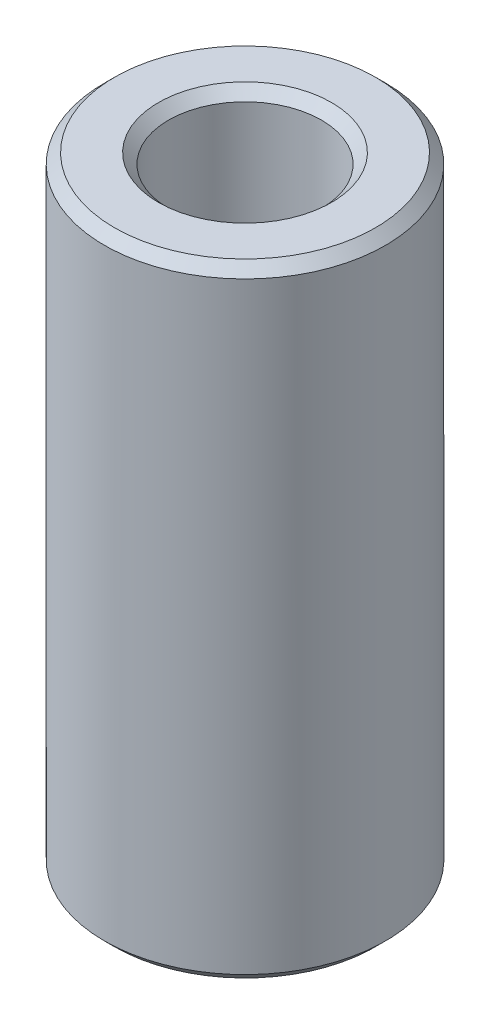
ISO-10303-21;
HEADER;
FILE_DESCRIPTION(('STEP AP214'),'2;1');
FILE_NAME('part.step','',(''),(''),'','','');
FILE_SCHEMA(('AUTOMOTIVE_DESIGN { 1 0 10303 214 1 1 1 1 }'));
ENDSEC;
DATA;
#1=APPLICATION_CONTEXT('core data for automotive mechanical design processes');
#2=APPLICATION_PROTOCOL_DEFINITION('international standard','automotive_design',2000,#1);
#3=PRODUCT_CONTEXT('',#1,'mechanical');
#4=PRODUCT('Part','Part','',(#3));
#5=PRODUCT_RELATED_PRODUCT_CATEGORY('part','',(#4));
#6=PRODUCT_DEFINITION_FORMATION('','',#4);
#7=PRODUCT_DEFINITION_CONTEXT('part definition',#1,'design');
#8=PRODUCT_DEFINITION('design','',#6,#7);
#9=PRODUCT_DEFINITION_SHAPE('','',#8);
#10=(LENGTH_UNIT() NAMED_UNIT(*) SI_UNIT(.MILLI.,.METRE.));
#11=(NAMED_UNIT(*) PLANE_ANGLE_UNIT() SI_UNIT($,.RADIAN.));
#12=(NAMED_UNIT(*) SI_UNIT($,.STERADIAN.) SOLID_ANGLE_UNIT());
#13=UNCERTAINTY_MEASURE_WITH_UNIT(LENGTH_MEASURE(1.E-05),#10,'distance_accuracy_value','');
#14=(GEOMETRIC_REPRESENTATION_CONTEXT(3) GLOBAL_UNCERTAINTY_ASSIGNED_CONTEXT((#13)) GLOBAL_UNIT_ASSIGNED_CONTEXT((#10,
#11,#12)) REPRESENTATION_CONTEXT('',''));
#15=CARTESIAN_POINT('',(0.,0.,0.));
#16=DIRECTION('',(0.,0.,1.));
#17=DIRECTION('',(1.,0.,0.));
#18=AXIS2_PLACEMENT_3D('',#15,#16,#17);
#19=CARTESIAN_POINT('',(0.,221.459907417285,0.));
#20=DIRECTION('',(0.,-1.,0.));
#21=DIRECTION('',(0.,0.,-1.));
#22=AXIS2_PLACEMENT_3D('',#19,#20,#21);
#23=CYLINDRICAL_SURFACE('',#22,50.);
#24=CARTESIAN_POINT('',(0.,3.60324062554759,0.));
#25=DIRECTION('',(0.,1.,0.));
#26=DIRECTION('',(0.,0.,1.));
#27=AXIS2_PLACEMENT_3D('',#24,#25,#26);
#28=CIRCLE('',#27,50.);
#29=CARTESIAN_POINT('',(0.,3.60324062554757,-50.));
#30=VERTEX_POINT('',#29);
#31=EDGE_CURVE('E10',#30,#30,#28,.T.);
#32=CARTESIAN_POINT('',(0.,217.856666791738,0.));
#33=DIRECTION('',(0.,1.,0.));
#34=DIRECTION('',(0.,0.,1.));
#35=AXIS2_PLACEMENT_3D('',#32,#33,#34);
#36=CIRCLE('',#35,50.);
#37=CARTESIAN_POINT('',(0.,217.856666791738,-50.));
#38=VERTEX_POINT('',#37);
#39=EDGE_CURVE('E50',#38,#38,#36,.F.);
#40=CARTESIAN_POINT('',(0.,3.60324062554757,-50.));
#41=CARTESIAN_POINT('',(0.,5.83504714811205,-50.));
#42=CARTESIAN_POINT('',(0.,8.06685367067654,-50.));
#43=CARTESIAN_POINT('',(0.,12.5304667158055,-50.));
#44=CARTESIAN_POINT('',(0.,14.76227323837,-50.));
#45=CARTESIAN_POINT('',(0.,19.225886283499,-50.));
#46=CARTESIAN_POINT('',(0.,21.4576928060634,-50.));
#47=CARTESIAN_POINT('',(0.,25.9213058511924,-50.));
#48=CARTESIAN_POINT('',(0.,28.1531123737569,-50.));
#49=CARTESIAN_POINT('',(0.,32.6167254188859,-50.));
#50=CARTESIAN_POINT('',(0.,34.8485319414504,-50.));
#51=CARTESIAN_POINT('',(0.,39.3121449865793,-50.));
#52=CARTESIAN_POINT('',(0.,41.5439515091438,-50.));
#53=CARTESIAN_POINT('',(0.,46.0075645542728,-50.));
#54=CARTESIAN_POINT('',(0.,48.2393710768373,-50.));
#55=CARTESIAN_POINT('',(0.,52.7029841219663,-50.));
#56=CARTESIAN_POINT('',(0.,54.9347906445307,-50.));
#57=CARTESIAN_POINT('',(0.,59.3984036896597,-50.));
#58=CARTESIAN_POINT('',(0.,61.6302102122242,-50.));
#59=CARTESIAN_POINT('',(0.,66.0938232573532,-50.));
#60=CARTESIAN_POINT('',(0.,68.3256297799176,-50.));
#61=CARTESIAN_POINT('',(0.,72.7892428250466,-50.));
#62=CARTESIAN_POINT('',(0.,75.0210493476111,-50.));
#63=CARTESIAN_POINT('',(0.,79.4846623927401,-50.));
#64=CARTESIAN_POINT('',(0.,81.7164689153046,-50.));
#65=CARTESIAN_POINT('',(0.,86.1800819604335,-50.));
#66=CARTESIAN_POINT('',(0.,88.411888482998,-50.));
#67=CARTESIAN_POINT('',(0.,92.875501528127,-50.));
#68=CARTESIAN_POINT('',(0.,95.1073080506915,-50.));
#69=CARTESIAN_POINT('',(0.,99.5709210958204,-50.));
#70=CARTESIAN_POINT('',(0.,101.802727618385,-50.));
#71=CARTESIAN_POINT('',(0.,106.266340663514,-50.));
#72=CARTESIAN_POINT('',(0.,108.498147186078,-50.));
#73=CARTESIAN_POINT('',(0.,112.961760231207,-50.));
#74=CARTESIAN_POINT('',(0.,115.193566753772,-50.));
#75=CARTESIAN_POINT('',(0.,119.657179798901,-50.));
#76=CARTESIAN_POINT('',(0.,121.888986321465,-50.));
#77=CARTESIAN_POINT('',(0.,126.352599366594,-50.));
#78=CARTESIAN_POINT('',(0.,128.584405889159,-50.));
#79=CARTESIAN_POINT('',(0.,133.048018934288,-50.));
#80=CARTESIAN_POINT('',(0.,135.279825456852,-50.));
#81=CARTESIAN_POINT('',(0.,139.743438501981,-50.));
#82=CARTESIAN_POINT('',(0.,141.975245024546,-50.));
#83=CARTESIAN_POINT('',(0.,146.438858069675,-50.));
#84=CARTESIAN_POINT('',(0.,148.670664592239,-50.));
#85=CARTESIAN_POINT('',(0.,153.134277637368,-50.));
#86=CARTESIAN_POINT('',(0.,155.366084159933,-50.));
#87=CARTESIAN_POINT('',(0.,159.829697205062,-50.));
#88=CARTESIAN_POINT('',(0.,162.061503727626,-50.));
#89=CARTESIAN_POINT('',(0.,166.525116772755,-50.));
#90=CARTESIAN_POINT('',(0.,168.756923295319,-50.));
#91=CARTESIAN_POINT('',(0.,173.220536340448,-50.));
#92=CARTESIAN_POINT('',(0.,175.452342863013,-50.));
#93=CARTESIAN_POINT('',(0.,179.915955908142,-50.));
#94=CARTESIAN_POINT('',(0.,182.147762430706,-50.));
#95=CARTESIAN_POINT('',(0.,186.611375475835,-50.));
#96=CARTESIAN_POINT('',(0.,188.8431819984,-50.));
#97=CARTESIAN_POINT('',(0.,193.306795043529,-50.));
#98=CARTESIAN_POINT('',(0.,195.538601566093,-50.));
#99=CARTESIAN_POINT('',(0.,200.002214611222,-50.));
#100=CARTESIAN_POINT('',(0.,202.234021133787,-50.));
#101=CARTESIAN_POINT('',(0.,206.697634178916,-50.));
#102=CARTESIAN_POINT('',(0.,208.92944070148,-50.));
#103=CARTESIAN_POINT('',(0.,213.393053746609,-50.));
#104=CARTESIAN_POINT('',(0.,215.624860269174,-50.));
#105=CARTESIAN_POINT('',(0.,217.856666791738,-50.));
#106=B_SPLINE_CURVE_WITH_KNOTS('',3,(#40,#41,#42,#43,#44,#45,#46,#47,#48,#49,#50,#51,#52,#53,
#54,#55,#56,#57,#58,#59,#60,#61,#62,#63,#64,#65,#66,#67,#68,#69,#70,#71,#72,#73,#74,#75,#76,#77,
#78,#79,#80,#81,#82,#83,#84,#85,#86,#87,#88,#89,#90,#91,#92,#93,#94,#95,#96,#97,#98,#99,#100,
#101,#102,#103,#104,#105),.UNSPECIFIED.,.F.,.F.,(4,2,2,2,2,2,2,2,2,2,2,2,2,2,2,2,2,2,2,2,2,2,2,
2,2,2,2,2,2,2,2,2,4),(0.,6.69541956769346,13.3908391353869,20.0862587030804,26.7816782707738,
33.4770978384673,40.1725174061607,46.8679369738542,53.5633565415476,60.2587761092411,
66.9541956769346,73.649615244628,80.3450348123215,87.0404543800149,93.7358739477084,
100.431293515402,107.126713083095,113.822132650789,120.517552218482,127.212971786176,
133.908391353869,140.603810921563,147.299230489256,153.99465005695,160.690069624643,
167.385489192336,174.08090876003,180.776328327723,187.471747895417,194.16716746311,
200.862587030804,207.558006598497,214.253426166191),.UNSPECIFIED.);
#107=EDGE_CURVE('BSEAM39',#30,#38,#106,.T.);
#108=ORIENTED_EDGE('',*,*,#31,.T.);
#109=ORIENTED_EDGE('',*,*,#39,.T.);
#110=ORIENTED_EDGE('',*,*,#107,.T.);
#111=ORIENTED_EDGE('',*,*,#107,.F.);
#112=EDGE_LOOP('',(#108,#110,#109,#111));
#113=FACE_BOUND('',#112,.T.);
#114=ADVANCED_FACE('F39',(#113),#23,.T.);
#115=CARTESIAN_POINT('',(0.,221.459907417285,0.));
#116=DIRECTION('',(0.,1.,0.));
#117=DIRECTION('',(0.,0.,1.));
#118=AXIS2_PLACEMENT_3D('',#115,#116,#117);
#119=PLANE('',#118);
#120=CARTESIAN_POINT('',(0.,221.459907417285,0.));
#121=DIRECTION('',(0.,1.,0.));
#122=DIRECTION('',(0.,0.,1.));
#123=AXIS2_PLACEMENT_3D('',#120,#121,#122);
#124=CIRCLE('',#123,30.7904550652698);
#125=CARTESIAN_POINT('',(0.,221.459907417285,30.7904550652698));
#126=VERTEX_POINT('',#125);
#127=EDGE_CURVE('E58',#126,#126,#124,.F.);
#128=ORIENTED_EDGE('',*,*,#127,.T.);
#129=EDGE_LOOP('',(#128));
#130=FACE_BOUND('',#129,.T.);
#131=CARTESIAN_POINT('',(0.,221.459907417285,0.));
#132=DIRECTION('',(0.,1.,0.));
#133=DIRECTION('',(0.,0.,1.));
#134=AXIS2_PLACEMENT_3D('',#131,#132,#133);
#135=CIRCLE('',#134,46.3967593744527);
#136=CARTESIAN_POINT('',(0.,221.459907417285,46.3967593744527));
#137=VERTEX_POINT('',#136);
#138=EDGE_CURVE('E61',#137,#137,#135,.T.);
#139=ORIENTED_EDGE('',*,*,#138,.T.);
#140=EDGE_LOOP('',(#139));
#141=FACE_BOUND('',#140,.T.);
#142=ADVANCED_FACE('F88',(#130,#141),#119,.T.);
#143=CARTESIAN_POINT('',(0.,0.,0.));
#144=DIRECTION('',(0.,1.,0.));
#145=DIRECTION('',(0.,0.,1.));
#146=AXIS2_PLACEMENT_3D('',#143,#144,#145);
#147=PLANE('',#146);
#148=CARTESIAN_POINT('',(0.,0.,0.));
#149=DIRECTION('',(0.,1.,0.));
#150=DIRECTION('',(0.,0.,1.));
#151=AXIS2_PLACEMENT_3D('',#148,#149,#150);
#152=CIRCLE('',#151,30.7904550652696);
#153=CARTESIAN_POINT('',(0.,0.,30.7904550652696));
#154=VERTEX_POINT('',#153);
#155=EDGE_CURVE('E51',#154,#154,#152,.T.);
#156=ORIENTED_EDGE('',*,*,#155,.T.);
#157=EDGE_LOOP('',(#156));
#158=FACE_BOUND('',#157,.T.);
#159=CARTESIAN_POINT('',(0.,0.,0.));
#160=DIRECTION('',(0.,1.,0.));
#161=DIRECTION('',(0.,0.,1.));
#162=AXIS2_PLACEMENT_3D('',#159,#160,#161);
#163=CIRCLE('',#162,46.3967593744524);
#164=CARTESIAN_POINT('',(0.,0.,46.3967593744524));
#165=VERTEX_POINT('',#164);
#166=EDGE_CURVE('E54',#165,#165,#163,.F.);
#167=ORIENTED_EDGE('',*,*,#166,.T.);
#168=EDGE_LOOP('',(#167));
#169=FACE_BOUND('',#168,.T.);
#170=ADVANCED_FACE('F83',(#158,#169),#147,.F.);
#171=CARTESIAN_POINT('',(0.,221.459907417285,0.));
#172=DIRECTION('',(0.,-1.,0.));
#173=DIRECTION('',(0.,0.,-1.));
#174=AXIS2_PLACEMENT_3D('',#171,#172,#173);
#175=CYLINDRICAL_SURFACE('',#174,27.1872144397223);
#176=CARTESIAN_POINT('',(0.,217.856666791738,0.));
#177=DIRECTION('',(0.,1.,0.));
#178=DIRECTION('',(0.,0.,1.));
#179=AXIS2_PLACEMENT_3D('',#176,#177,#178);
#180=CIRCLE('',#179,27.1872144397223);
#181=CARTESIAN_POINT('',(0.,217.856666791738,-27.1872144397223));
#182=VERTEX_POINT('',#181);
#183=EDGE_CURVE('E67',#182,#182,#180,.T.);
#184=CARTESIAN_POINT('',(0.,3.60324062554737,0.));
#185=DIRECTION('',(0.,1.,0.));
#186=DIRECTION('',(0.,0.,1.));
#187=AXIS2_PLACEMENT_3D('',#184,#185,#186);
#188=CIRCLE('',#187,27.1872144397223);
#189=CARTESIAN_POINT('',(0.,3.60324062554734,-27.1872144397223));
#190=VERTEX_POINT('',#189);
#191=EDGE_CURVE('E69',#190,#190,#188,.F.);
#192=CARTESIAN_POINT('',(0.,217.856666791738,-27.1872144397223));
#193=CARTESIAN_POINT('',(0.,215.624860269173,-27.1872144397223));
#194=CARTESIAN_POINT('',(0.,213.393053746609,-27.1872144397223));
#195=CARTESIAN_POINT('',(0.,208.92944070148,-27.1872144397223));
#196=CARTESIAN_POINT('',(0.,206.697634178916,-27.1872144397223));
#197=CARTESIAN_POINT('',(0.,202.234021133787,-27.1872144397223));
#198=CARTESIAN_POINT('',(0.,200.002214611222,-27.1872144397223));
#199=CARTESIAN_POINT('',(0.,195.538601566093,-27.1872144397223));
#200=CARTESIAN_POINT('',(0.,193.306795043529,-27.1872144397223));
#201=CARTESIAN_POINT('',(0.,188.8431819984,-27.1872144397223));
#202=CARTESIAN_POINT('',(0.,186.611375475835,-27.1872144397223));
#203=CARTESIAN_POINT('',(0.,182.147762430706,-27.1872144397223));
#204=CARTESIAN_POINT('',(0.,179.915955908142,-27.1872144397223));
#205=CARTESIAN_POINT('',(0.,175.452342863013,-27.1872144397223));
#206=CARTESIAN_POINT('',(0.,173.220536340448,-27.1872144397223));
#207=CARTESIAN_POINT('',(0.,168.756923295319,-27.1872144397223));
#208=CARTESIAN_POINT('',(0.,166.525116772755,-27.1872144397223));
#209=CARTESIAN_POINT('',(0.,162.061503727626,-27.1872144397223));
#210=CARTESIAN_POINT('',(0.,159.829697205061,-27.1872144397223));
#211=CARTESIAN_POINT('',(0.,155.366084159932,-27.1872144397223));
#212=CARTESIAN_POINT('',(0.,153.134277637368,-27.1872144397223));
#213=CARTESIAN_POINT('',(0.,148.670664592239,-27.1872144397223));
#214=CARTESIAN_POINT('',(0.,146.438858069674,-27.1872144397223));
#215=CARTESIAN_POINT('',(0.,141.975245024545,-27.1872144397223));
#216=CARTESIAN_POINT('',(0.,139.743438501981,-27.1872144397223));
#217=CARTESIAN_POINT('',(0.,135.279825456852,-27.1872144397223));
#218=CARTESIAN_POINT('',(0.,133.048018934288,-27.1872144397223));
#219=CARTESIAN_POINT('',(0.,128.584405889159,-27.1872144397223));
#220=CARTESIAN_POINT('',(0.,126.352599366594,-27.1872144397223));
#221=CARTESIAN_POINT('',(0.,121.888986321465,-27.1872144397223));
#222=CARTESIAN_POINT('',(0.,119.657179798901,-27.1872144397223));
#223=CARTESIAN_POINT('',(0.,115.193566753772,-27.1872144397223));
#224=CARTESIAN_POINT('',(0.,112.961760231207,-27.1872144397223));
#225=CARTESIAN_POINT('',(0.,108.498147186078,-27.1872144397223));
#226=CARTESIAN_POINT('',(0.,106.266340663514,-27.1872144397223));
#227=CARTESIAN_POINT('',(0.,101.802727618385,-27.1872144397223));
#228=CARTESIAN_POINT('',(0.,99.5709210958202,-27.1872144397223));
#229=CARTESIAN_POINT('',(0.,95.1073080506912,-27.1872144397223));
#230=CARTESIAN_POINT('',(0.,92.8755015281267,-27.1872144397223));
#231=CARTESIAN_POINT('',(0.,88.4118884829978,-27.1872144397223));
#232=CARTESIAN_POINT('',(0.,86.1800819604333,-27.1872144397223));
#233=CARTESIAN_POINT('',(0.,81.7164689153043,-27.1872144397223));
#234=CARTESIAN_POINT('',(0.,79.4846623927398,-27.1872144397223));
#235=CARTESIAN_POINT('',(0.,75.0210493476109,-27.1872144397223));
#236=CARTESIAN_POINT('',(0.,72.7892428250464,-27.1872144397223));
#237=CARTESIAN_POINT('',(0.,68.3256297799174,-27.1872144397223));
#238=CARTESIAN_POINT('',(0.,66.0938232573529,-27.1872144397223));
#239=CARTESIAN_POINT('',(0.,61.630210212224,-27.1872144397223));
#240=CARTESIAN_POINT('',(0.,59.3984036896595,-27.1872144397223));
#241=CARTESIAN_POINT('',(0.,54.9347906445305,-27.1872144397223));
#242=CARTESIAN_POINT('',(0.,52.702984121966,-27.1872144397223));
#243=CARTESIAN_POINT('',(0.,48.239371076837,-27.1872144397223));
#244=CARTESIAN_POINT('',(0.,46.0075645542726,-27.1872144397223));
#245=CARTESIAN_POINT('',(0.,41.5439515091436,-27.1872144397223));
#246=CARTESIAN_POINT('',(0.,39.3121449865791,-27.1872144397223));
#247=CARTESIAN_POINT('',(0.,34.8485319414501,-27.1872144397223));
#248=CARTESIAN_POINT('',(0.,32.6167254188857,-27.1872144397223));
#249=CARTESIAN_POINT('',(0.,28.1531123737567,-27.1872144397223));
#250=CARTESIAN_POINT('',(0.,25.9213058511922,-27.1872144397223));
#251=CARTESIAN_POINT('',(0.,21.4576928060632,-27.1872144397223));
#252=CARTESIAN_POINT('',(0.,19.2258862834987,-27.1872144397223));
#253=CARTESIAN_POINT('',(0.,14.7622732383698,-27.1872144397223));
#254=CARTESIAN_POINT('',(0.,12.5304667158053,-27.1872144397223));
#255=CARTESIAN_POINT('',(0.,8.06685367067631,-27.1872144397223));
#256=CARTESIAN_POINT('',(0.,5.83504714811183,-27.1872144397223));
#257=CARTESIAN_POINT('',(0.,3.60324062554734,-27.1872144397223));
#258=B_SPLINE_CURVE_WITH_KNOTS('',3,(#192,#193,#194,#195,#196,#197,#198,#199,#200,#201,#202,
#203,#204,#205,#206,#207,#208,#209,#210,#211,#212,#213,#214,#215,#216,#217,#218,#219,#220,#221,
#222,#223,#224,#225,#226,#227,#228,#229,#230,#231,#232,#233,#234,#235,#236,#237,#238,#239,#240,
#241,#242,#243,#244,#245,#246,#247,#248,#249,#250,#251,#252,#253,#254,#255,#256,#257),
.UNSPECIFIED.,.F.,.F.,(4,2,2,2,2,2,2,2,2,2,2,2,2,2,2,2,2,2,2,2,2,2,2,2,2,2,2,2,2,2,2,2,4),(0.,
6.69541956769343,13.3908391353869,20.0862587030803,26.7816782707738,33.4770978384673,
40.1725174061607,46.8679369738542,53.5633565415476,60.2587761092411,66.9541956769345,
73.649615244628,80.3450348123214,87.0404543800149,93.7358739477084,100.431293515402,
107.126713083095,113.822132650789,120.517552218482,127.212971786176,133.908391353869,
140.603810921563,147.299230489256,153.994650056949,160.690069624643,167.385489192336,
174.08090876003,180.776328327723,187.471747895417,194.16716746311,200.862587030804,
207.558006598497,214.253426166191),.UNSPECIFIED.);
#259=EDGE_CURVE('BSEAM71',#182,#190,#258,.T.);
#260=ORIENTED_EDGE('',*,*,#183,.T.);
#261=ORIENTED_EDGE('',*,*,#191,.T.);
#262=ORIENTED_EDGE('',*,*,#259,.T.);
#263=ORIENTED_EDGE('',*,*,#259,.F.);
#264=EDGE_LOOP('',(#260,#262,#261,#263));
#265=FACE_BOUND('',#264,.T.);
#266=ADVANCED_FACE('F71',(#265),#175,.F.);
#267=CARTESIAN_POINT('',(0.,217.856666791738,0.));
#268=DIRECTION('',(0.,1.,0.));
#269=DIRECTION('',(0.,0.,1.));
#270=AXIS2_PLACEMENT_3D('',#267,#268,#269);
#271=CONICAL_SURFACE('',#270,27.1872144397223,0.785398163397448);
#272=ORIENTED_EDGE('',*,*,#127,.F.);
#273=EDGE_LOOP('',(#272));
#274=FACE_BOUND('',#273,.T.);
#275=ORIENTED_EDGE('',*,*,#183,.F.);
#276=EDGE_LOOP('',(#275));
#277=FACE_BOUND('',#276,.T.);
#278=ADVANCED_FACE('F77',(#274,#277),#271,.F.);
#279=CARTESIAN_POINT('',(0.,0.,0.));
#280=DIRECTION('',(0.,-1.,0.));
#281=DIRECTION('',(0.,0.,-1.));
#282=AXIS2_PLACEMENT_3D('',#279,#280,#281);
#283=CONICAL_SURFACE('',#282,30.7904550652696,0.785398163397441);
#284=ORIENTED_EDGE('',*,*,#191,.F.);
#285=EDGE_LOOP('',(#284));
#286=FACE_BOUND('',#285,.T.);
#287=ORIENTED_EDGE('',*,*,#155,.F.);
#288=EDGE_LOOP('',(#287));
#289=FACE_BOUND('',#288,.T.);
#290=ADVANCED_FACE('F73',(#286,#289),#283,.F.);
#291=CARTESIAN_POINT('',(0.,3.60324062554759,0.));
#292=DIRECTION('',(0.,1.,0.));
#293=DIRECTION('',(0.,0.,1.));
#294=AXIS2_PLACEMENT_3D('',#291,#292,#293);
#295=CONICAL_SURFACE('',#294,50.,0.785398163397455);
#296=ORIENTED_EDGE('',*,*,#166,.F.);
#297=EDGE_LOOP('',(#296));
#298=FACE_BOUND('',#297,.T.);
#299=ORIENTED_EDGE('',*,*,#31,.F.);
#300=EDGE_LOOP('',(#299));
#301=FACE_BOUND('',#300,.T.);
#302=ADVANCED_FACE('F76',(#298,#301),#295,.T.);
#303=CARTESIAN_POINT('',(0.,221.459907417285,0.));
#304=DIRECTION('',(0.,-1.,0.));
#305=DIRECTION('',(0.,0.,-1.));
#306=AXIS2_PLACEMENT_3D('',#303,#304,#305);
#307=CONICAL_SURFACE('',#306,46.3967593744527,0.785398163397444);
#308=ORIENTED_EDGE('',*,*,#39,.F.);
#309=EDGE_LOOP('',(#308));
#310=FACE_BOUND('',#309,.T.);
#311=ORIENTED_EDGE('',*,*,#138,.F.);
#312=EDGE_LOOP('',(#311));
#313=FACE_BOUND('',#312,.T.);
#314=ADVANCED_FACE('F45',(#310,#313),#307,.T.);
#315=CLOSED_SHELL('',(#114,#142,#170,#266,#278,#290,#302,#314));
#316=MANIFOLD_SOLID_BREP('B2',#315);
#317=ADVANCED_BREP_SHAPE_REPRESENTATION('',(#18,#316),#14);
#318=SHAPE_DEFINITION_REPRESENTATION(#9,#317);
ENDSEC;
END-ISO-10303-21;
